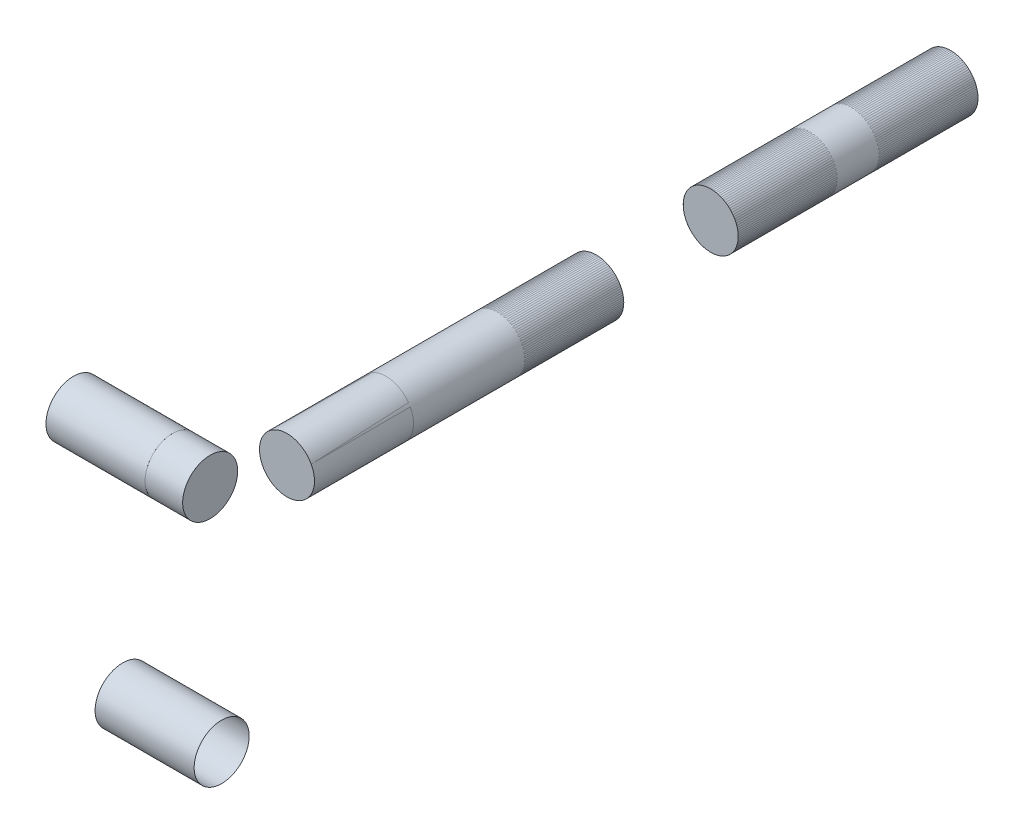
ISO-10303-21;
HEADER;
FILE_DESCRIPTION(('STEP AP214'),'2;1');
FILE_NAME('part.step','',(''),(''),'','','');
FILE_SCHEMA(('AUTOMOTIVE_DESIGN { 1 0 10303 214 1 1 1 1 }'));
ENDSEC;
DATA;
#1=APPLICATION_CONTEXT('core data for automotive mechanical design processes');
#2=APPLICATION_PROTOCOL_DEFINITION('international standard','automotive_design',2000,#1);
#3=PRODUCT_CONTEXT('',#1,'mechanical');
#4=PRODUCT('Part','Part','',(#3));
#5=PRODUCT_RELATED_PRODUCT_CATEGORY('part','',(#4));
#6=PRODUCT_DEFINITION_FORMATION('','',#4);
#7=PRODUCT_DEFINITION_CONTEXT('part definition',#1,'design');
#8=PRODUCT_DEFINITION('design','',#6,#7);
#9=PRODUCT_DEFINITION_SHAPE('','',#8);
#10=(LENGTH_UNIT() NAMED_UNIT(*) SI_UNIT(.MILLI.,.METRE.));
#11=(NAMED_UNIT(*) PLANE_ANGLE_UNIT() SI_UNIT($,.RADIAN.));
#12=(NAMED_UNIT(*) SI_UNIT($,.STERADIAN.) SOLID_ANGLE_UNIT());
#13=UNCERTAINTY_MEASURE_WITH_UNIT(LENGTH_MEASURE(1.E-05),#10,'distance_accuracy_value','');
#14=(GEOMETRIC_REPRESENTATION_CONTEXT(3) GLOBAL_UNCERTAINTY_ASSIGNED_CONTEXT((#13)) GLOBAL_UNIT_ASSIGNED_CONTEXT((#10,
#11,#12)) REPRESENTATION_CONTEXT('',''));
#15=CARTESIAN_POINT('',(0.,0.,0.));
#16=DIRECTION('',(0.,0.,1.));
#17=DIRECTION('',(1.,0.,0.));
#18=AXIS2_PLACEMENT_3D('',#15,#16,#17);
#19=CARTESIAN_POINT('',(-13.208,2.22044604925031E-13,143.472112962567));
#20=DIRECTION('',(1.,0.,0.));
#21=DIRECTION('',(0.,1.,0.));
#22=AXIS2_PLACEMENT_3D('',#19,#20,#21);
#23=PLANE('',#22);
#24=CARTESIAN_POINT('',(-13.208,2.22044604925031E-13,143.472112962567));
#25=DIRECTION('',(1.,0.,0.));
#26=DIRECTION('',(0.,1.,0.));
#27=AXIS2_PLACEMENT_3D('',#24,#25,#26);
#28=CIRCLE('',#27,6.35000000602767);
#29=CARTESIAN_POINT('',(-13.208,6.35000000602789,143.472112962567));
#30=VERTEX_POINT('',#29);
#31=EDGE_CURVE('E51',#30,#30,#28,.T.);
#32=ORIENTED_EDGE('',*,*,#31,.F.);
#33=EDGE_LOOP('',(#32));
#34=FACE_BOUND('',#33,.T.);
#35=ADVANCED_FACE('F44',(#34),#23,.F.);
#36=CARTESIAN_POINT('',(13.4401810440567,2.22654442016874E-13,143.472112962567));
#37=DIRECTION('',(-1.,0.,0.));
#38=DIRECTION('',(0.,-1.,0.));
#39=AXIS2_PLACEMENT_3D('',#36,#37,#38);
#40=CYLINDRICAL_SURFACE('',#39,6.35000000602767);
#41=CARTESIAN_POINT('',(-4.5203312151304,2.22243420095864E-13,143.472112962567));
#42=DIRECTION('',(-1.,0.,0.));
#43=DIRECTION('',(0.,-1.,0.));
#44=AXIS2_PLACEMENT_3D('',#41,#42,#43);
#45=CIRCLE('',#44,6.35000000602767);
#46=CARTESIAN_POINT('',(-4.52033121513041,-6.35000000602745,143.472112962567));
#47=VERTEX_POINT('',#46);
#48=EDGE_CURVE('E11',#47,#47,#45,.T.);
#49=ORIENTED_EDGE('',*,*,#48,.T.);
#50=EDGE_LOOP('',(#49));
#51=FACE_BOUND('',#50,.T.);
#52=ORIENTED_EDGE('',*,*,#31,.T.);
#53=EDGE_LOOP('',(#52));
#54=FACE_BOUND('',#53,.T.);
#55=ADVANCED_FACE('F46',(#51,#54),#40,.T.);
#56=CARTESIAN_POINT('',(-4.5203312151304,0.,0.));
#57=DIRECTION('',(-1.,0.,0.));
#58=DIRECTION('',(0.,-1.,0.));
#59=AXIS2_PLACEMENT_3D('',#56,#57,#58);
#60=PLANE('',#59);
#61=ORIENTED_EDGE('',*,*,#48,.F.);
#62=EDGE_LOOP('',(#61));
#63=FACE_BOUND('',#62,.T.);
#64=ADVANCED_FACE('F62',(#63),#60,.F.);
#65=CLOSED_SHELL('',(#35,#55,#64));
#66=MANIFOLD_SOLID_BREP('B2',#65);
#67=CARTESIAN_POINT('',(0.,0.,148.224625204705));
#68=DIRECTION('',(0.,0.,-1.));
#69=DIRECTION('',(-1.,0.,0.));
#70=AXIS2_PLACEMENT_3D('',#67,#68,#69);
#71=CYLINDRICAL_SURFACE('',#70,6.34999999999998);
#72=CARTESIAN_POINT('',(0.,0.,58.8901129625673));
#73=DIRECTION('',(0.,0.,1.));
#74=DIRECTION('',(1.,0.,0.));
#75=AXIS2_PLACEMENT_3D('',#72,#73,#74);
#76=CIRCLE('',#75,6.34999999999998);
#77=CARTESIAN_POINT('',(6.34999999999998,0.,58.8901129625673));
#78=VERTEX_POINT('',#77);
#79=EDGE_CURVE('E100',#78,#78,#76,.T.);
#80=ORIENTED_EDGE('',*,*,#79,.T.);
#81=EDGE_LOOP('',(#80));
#82=FACE_BOUND('',#81,.T.);
#83=CARTESIAN_POINT('',(0.,0.,130.264112962567));
#84=DIRECTION('',(0.,0.,1.));
#85=DIRECTION('',(1.,0.,0.));
#86=AXIS2_PLACEMENT_3D('',#83,#84,#85);
#87=CIRCLE('',#86,6.34999999999998);
#88=CARTESIAN_POINT('',(6.34999999999998,0.,130.264112962567));
#89=VERTEX_POINT('',#88);
#90=EDGE_CURVE('E43',#89,#89,#87,.T.);
#91=ORIENTED_EDGE('',*,*,#90,.F.);
#92=EDGE_LOOP('',(#91));
#93=FACE_BOUND('',#92,.T.);
#94=ADVANCED_FACE('F93',(#82,#93),#71,.T.);
#95=CARTESIAN_POINT('',(0.,0.,58.8901129625673));
#96=DIRECTION('',(0.,0.,1.));
#97=DIRECTION('',(1.,0.,0.));
#98=AXIS2_PLACEMENT_3D('',#95,#96,#97);
#99=PLANE('',#98);
#100=ORIENTED_EDGE('',*,*,#79,.F.);
#101=EDGE_LOOP('',(#100));
#102=FACE_BOUND('',#101,.T.);
#103=ADVANCED_FACE('F108',(#102),#99,.F.);
#104=CARTESIAN_POINT('',(0.,0.,130.264112962567));
#105=DIRECTION('',(0.,0.,1.));
#106=DIRECTION('',(1.,0.,0.));
#107=AXIS2_PLACEMENT_3D('',#104,#105,#106);
#108=PLANE('',#107);
#109=ORIENTED_EDGE('',*,*,#90,.T.);
#110=EDGE_LOOP('',(#109));
#111=FACE_BOUND('',#110,.T.);
#112=ADVANCED_FACE('F95',(#111),#108,.T.);
#113=CLOSED_SHELL('',(#94,#103,#112));
#114=MANIFOLD_SOLID_BREP('B6',#113);
#115=CARTESIAN_POINT('',(0.,0.,50.4346252047056));
#116=DIRECTION('',(0.,0.,-1.));
#117=DIRECTION('',(-1.,0.,0.));
#118=AXIS2_PLACEMENT_3D('',#115,#116,#117);
#119=CYLINDRICAL_SURFACE('',#118,6.35);
#120=CARTESIAN_POINT('',(0.,0.,-22.86));
#121=DIRECTION('',(0.,0.,1.));
#122=DIRECTION('',(1.,0.,0.));
#123=AXIS2_PLACEMENT_3D('',#120,#121,#122);
#124=CIRCLE('',#123,6.35);
#125=CARTESIAN_POINT('',(6.35,0.,-22.86));
#126=VERTEX_POINT('',#125);
#127=EDGE_CURVE('E149',#126,#126,#124,.T.);
#128=ORIENTED_EDGE('',*,*,#127,.T.);
#129=EDGE_LOOP('',(#128));
#130=FACE_BOUND('',#129,.T.);
#131=CARTESIAN_POINT('',(0.,0.,32.4741129625673));
#132=DIRECTION('',(0.,0.,1.));
#133=DIRECTION('',(1.,0.,0.));
#134=AXIS2_PLACEMENT_3D('',#131,#132,#133);
#135=CIRCLE('',#134,6.35);
#136=CARTESIAN_POINT('',(6.35,0.,32.4741129625673));
#137=VERTEX_POINT('',#136);
#138=EDGE_CURVE('E92',#137,#137,#135,.T.);
#139=ORIENTED_EDGE('',*,*,#138,.F.);
#140=EDGE_LOOP('',(#139));
#141=FACE_BOUND('',#140,.T.);
#142=ADVANCED_FACE('F142',(#130,#141),#119,.T.);
#143=CARTESIAN_POINT('',(0.,0.,-22.86));
#144=DIRECTION('',(0.,0.,1.));
#145=DIRECTION('',(1.,0.,0.));
#146=AXIS2_PLACEMENT_3D('',#143,#144,#145);
#147=PLANE('',#146);
#148=ORIENTED_EDGE('',*,*,#127,.F.);
#149=EDGE_LOOP('',(#148));
#150=FACE_BOUND('',#149,.T.);
#151=ADVANCED_FACE('F157',(#150),#147,.F.);
#152=CARTESIAN_POINT('',(0.,0.,32.4741129625673));
#153=DIRECTION('',(0.,0.,1.));
#154=DIRECTION('',(1.,0.,0.));
#155=AXIS2_PLACEMENT_3D('',#152,#153,#154);
#156=PLANE('',#155);
#157=ORIENTED_EDGE('',*,*,#138,.T.);
#158=EDGE_LOOP('',(#157));
#159=FACE_BOUND('',#158,.T.);
#160=ADVANCED_FACE('F144',(#159),#156,.T.);
#161=CLOSED_SHELL('',(#142,#151,#160));
#162=MANIFOLD_SOLID_BREP('B38',#161);
#163=CARTESIAN_POINT('',(6.90966878486959,-31.4131028691527,163.680376472798));
#164=DIRECTION('',(-1.,0.,0.));
#165=DIRECTION('',(0.,0.,1.));
#166=AXIS2_PLACEMENT_3D('',#163,#164,#165);
#167=CYLINDRICAL_SURFACE('',#166,6.35);
#168=CARTESIAN_POINT('',(18.3396687848696,-31.4131028691527,163.680376472798));
#169=DIRECTION('',(-1.,0.,0.));
#170=DIRECTION('',(0.,0.,1.));
#171=AXIS2_PLACEMENT_3D('',#168,#169,#170);
#172=CIRCLE('',#171,6.35);
#173=CARTESIAN_POINT('',(18.3396687848696,-31.4131028691527,170.030376472798));
#174=VERTEX_POINT('',#173);
#175=EDGE_CURVE('E195',#174,#174,#172,.T.);
#176=ORIENTED_EDGE('',*,*,#175,.F.);
#177=EDGE_LOOP('',(#176));
#178=FACE_BOUND('',#177,.T.);
#179=CARTESIAN_POINT('',(-4.52033121513041,-31.4131028691527,163.680376472798));
#180=DIRECTION('',(-1.,0.,0.));
#181=DIRECTION('',(0.,0.,1.));
#182=AXIS2_PLACEMENT_3D('',#179,#180,#181);
#183=CIRCLE('',#182,6.35);
#184=CARTESIAN_POINT('',(-4.52033121513041,-31.4131028691527,170.030376472798));
#185=VERTEX_POINT('',#184);
#186=EDGE_CURVE('E141',#185,#185,#183,.F.);
#187=ORIENTED_EDGE('',*,*,#186,.F.);
#188=EDGE_LOOP('',(#187));
#189=FACE_BOUND('',#188,.T.);
#190=ADVANCED_FACE('F191',(#178,#189),#167,.F.);
#191=OPEN_SHELL('',(#190));
#192=SHELL_BASED_SURFACE_MODEL('B87',(#191));
#193=CARTESIAN_POINT('',(0.,2.22044604925031E-13,118.834112962567));
#194=DIRECTION('',(0.,0.,1.));
#195=DIRECTION('',(1.,0.,0.));
#196=AXIS2_PLACEMENT_3D('',#193,#194,#195);
#197=CYLINDRICAL_SURFACE('',#196,6.35);
#198=CARTESIAN_POINT('',(0.,2.22044604925031E-13,107.404112962567));
#199=DIRECTION('',(0.,0.,1.));
#200=DIRECTION('',(1.,0.,0.));
#201=AXIS2_PLACEMENT_3D('',#198,#199,#200);
#202=CIRCLE('',#201,6.35);
#203=CARTESIAN_POINT('',(6.35000000000001,2.22044604925031E-13,107.404112962567));
#204=VERTEX_POINT('',#203);
#205=EDGE_CURVE('E190',#204,#204,#202,.T.);
#206=ORIENTED_EDGE('',*,*,#205,.F.);
#207=EDGE_LOOP('',(#206));
#208=FACE_BOUND('',#207,.T.);
#209=CARTESIAN_POINT('',(0.,2.22044604925031E-13,130.264112962567));
#210=DIRECTION('',(0.,0.,1.));
#211=DIRECTION('',(1.,0.,0.));
#212=AXIS2_PLACEMENT_3D('',#209,#210,#211);
#213=CIRCLE('',#212,6.35);
#214=CARTESIAN_POINT('',(6.35000000000001,2.22044604925031E-13,130.264112962567));
#215=VERTEX_POINT('',#214);
#216=EDGE_CURVE('E227',#215,#215,#213,.F.);
#217=ORIENTED_EDGE('',*,*,#216,.F.);
#218=EDGE_LOOP('',(#217));
#219=FACE_BOUND('',#218,.T.);
#220=ADVANCED_FACE('F223',(#208,#219),#197,.F.);
#221=OPEN_SHELL('',(#220));
#222=SHELL_BASED_SURFACE_MODEL('B136',(#221));
#223=CARTESIAN_POINT('',(-24.638,2.22044604925031E-13,143.472112962567));
#224=DIRECTION('',(1.,0.,0.));
#225=DIRECTION('',(0.,0.,-1.));
#226=AXIS2_PLACEMENT_3D('',#223,#224,#225);
#227=CYLINDRICAL_SURFACE('',#226,6.35);
#228=CARTESIAN_POINT('',(-36.068,2.22044604925031E-13,143.472112962567));
#229=DIRECTION('',(1.,0.,0.));
#230=DIRECTION('',(0.,0.,-1.));
#231=AXIS2_PLACEMENT_3D('',#228,#229,#230);
#232=CIRCLE('',#231,6.35);
#233=CARTESIAN_POINT('',(-36.068,2.22044604925031E-13,137.122112962567));
#234=VERTEX_POINT('',#233);
#235=EDGE_CURVE('E259',#234,#234,#232,.T.);
#236=ORIENTED_EDGE('',*,*,#235,.F.);
#237=EDGE_LOOP('',(#236));
#238=FACE_BOUND('',#237,.T.);
#239=CARTESIAN_POINT('',(-13.208,2.22044604925031E-13,143.472112962567));
#240=DIRECTION('',(1.,0.,0.));
#241=DIRECTION('',(0.,0.,-1.));
#242=AXIS2_PLACEMENT_3D('',#239,#240,#241);
#243=CIRCLE('',#242,6.35);
#244=CARTESIAN_POINT('',(-13.208,2.22044604925031E-13,137.122112962567));
#245=VERTEX_POINT('',#244);
#246=EDGE_CURVE('E222',#245,#245,#243,.F.);
#247=ORIENTED_EDGE('',*,*,#246,.F.);
#248=EDGE_LOOP('',(#247));
#249=FACE_BOUND('',#248,.T.);
#250=ADVANCED_FACE('F255',(#238,#249),#227,.F.);
#251=OPEN_SHELL('',(#250));
#252=SHELL_BASED_SURFACE_MODEL('B185',(#251));
#253=CARTESIAN_POINT('',(0.,0.,21.0441129625673));
#254=DIRECTION('',(0.,0.,1.));
#255=DIRECTION('',(0.,-1.,0.));
#256=AXIS2_PLACEMENT_3D('',#253,#254,#255);
#257=CYLINDRICAL_SURFACE('',#256,6.35);
#258=CARTESIAN_POINT('',(0.,0.,9.61411296256728));
#259=DIRECTION('',(0.,0.,1.));
#260=DIRECTION('',(0.,-1.,0.));
#261=AXIS2_PLACEMENT_3D('',#258,#259,#260);
#262=CIRCLE('',#261,6.35);
#263=CARTESIAN_POINT('',(0.,-6.34999999999999,9.61411296256728));
#264=VERTEX_POINT('',#263);
#265=EDGE_CURVE('E254',#264,#264,#262,.T.);
#266=ORIENTED_EDGE('',*,*,#265,.F.);
#267=EDGE_LOOP('',(#266));
#268=FACE_BOUND('',#267,.T.);
#269=CARTESIAN_POINT('',(0.,0.,32.4741129625673));
#270=DIRECTION('',(0.,0.,1.));
#271=DIRECTION('',(0.,-1.,0.));
#272=AXIS2_PLACEMENT_3D('',#269,#270,#271);
#273=CIRCLE('',#272,6.35);
#274=CARTESIAN_POINT('',(0.,-6.34999999999999,32.4741129625673));
#275=VERTEX_POINT('',#274);
#276=EDGE_CURVE('E291',#275,#275,#273,.F.);
#277=ORIENTED_EDGE('',*,*,#276,.F.);
#278=EDGE_LOOP('',(#277));
#279=FACE_BOUND('',#278,.T.);
#280=ADVANCED_FACE('F287',(#268,#279),#257,.F.);
#281=OPEN_SHELL('',(#280));
#282=SHELL_BASED_SURFACE_MODEL('B217',(#281));
#283=CARTESIAN_POINT('',(0.,0.,70.3201129625673));
#284=DIRECTION('',(0.,0.,-1.));
#285=DIRECTION('',(0.,1.,0.));
#286=AXIS2_PLACEMENT_3D('',#283,#284,#285);
#287=CYLINDRICAL_SURFACE('',#286,6.35);
#288=CARTESIAN_POINT('',(0.,0.,81.7501129625673));
#289=DIRECTION('',(0.,0.,-1.));
#290=DIRECTION('',(0.,1.,0.));
#291=AXIS2_PLACEMENT_3D('',#288,#289,#290);
#292=CIRCLE('',#291,6.35);
#293=CARTESIAN_POINT('',(0.,6.35,81.7501129625673));
#294=VERTEX_POINT('',#293);
#295=EDGE_CURVE('E322',#294,#294,#292,.T.);
#296=ORIENTED_EDGE('',*,*,#295,.F.);
#297=EDGE_LOOP('',(#296));
#298=FACE_BOUND('',#297,.T.);
#299=CARTESIAN_POINT('',(0.,0.,58.8901129625673));
#300=DIRECTION('',(0.,0.,-1.));
#301=DIRECTION('',(0.,1.,0.));
#302=AXIS2_PLACEMENT_3D('',#299,#300,#301);
#303=CIRCLE('',#302,6.35);
#304=CARTESIAN_POINT('',(0.,6.35000000000001,58.8901129625673));
#305=VERTEX_POINT('',#304);
#306=EDGE_CURVE('E286',#305,#305,#303,.F.);
#307=ORIENTED_EDGE('',*,*,#306,.F.);
#308=EDGE_LOOP('',(#307));
#309=FACE_BOUND('',#308,.T.);
#310=ADVANCED_FACE('F318',(#298,#309),#287,.F.);
#311=OPEN_SHELL('',(#310));
#312=SHELL_BASED_SURFACE_MODEL('B249',(#311));
#313=CARTESIAN_POINT('',(0.,0.,-11.43));
#314=DIRECTION('',(0.,0.,-1.));
#315=DIRECTION('',(-1.,0.,0.));
#316=AXIS2_PLACEMENT_3D('',#313,#314,#315);
#317=CYLINDRICAL_SURFACE('',#316,6.35);
#318=CARTESIAN_POINT('',(0.,0.,0.));
#319=DIRECTION('',(0.,0.,-1.));
#320=DIRECTION('',(-1.,0.,0.));
#321=AXIS2_PLACEMENT_3D('',#318,#319,#320);
#322=CIRCLE('',#321,6.35);
#323=CARTESIAN_POINT('',(-6.35,0.,0.));
#324=VERTEX_POINT('',#323);
#325=EDGE_CURVE('E347',#324,#324,#322,.T.);
#326=ORIENTED_EDGE('',*,*,#325,.F.);
#327=EDGE_LOOP('',(#326));
#328=FACE_BOUND('',#327,.T.);
#329=CARTESIAN_POINT('',(0.,0.,-22.86));
#330=DIRECTION('',(0.,0.,-1.));
#331=DIRECTION('',(-1.,0.,0.));
#332=AXIS2_PLACEMENT_3D('',#329,#330,#331);
#333=CIRCLE('',#332,6.35);
#334=CARTESIAN_POINT('',(-6.35,0.,-22.86));
#335=VERTEX_POINT('',#334);
#336=EDGE_CURVE('E317',#335,#335,#333,.F.);
#337=ORIENTED_EDGE('',*,*,#336,.F.);
#338=EDGE_LOOP('',(#337));
#339=FACE_BOUND('',#338,.T.);
#340=ADVANCED_FACE('F343',(#328,#339),#317,.F.);
#341=OPEN_SHELL('',(#340));
#342=SHELL_BASED_SURFACE_MODEL('B281',(#341));
#343=ADVANCED_BREP_SHAPE_REPRESENTATION('',(#18,#66,#114,#162),#14);
#344=MANIFOLD_SURFACE_SHAPE_REPRESENTATION('',(#18,#192,#222,#252,#282,#312,#342),#14);
#345=SHAPE_REPRESENTATION('',(#18),#14);
#346=SHAPE_DEFINITION_REPRESENTATION(#9,#345);
#347=SHAPE_REPRESENTATION_RELATIONSHIP('','',#345,#343);
#348=SHAPE_REPRESENTATION_RELATIONSHIP('','',#345,#344);
ENDSEC;
END-ISO-10303-21;
